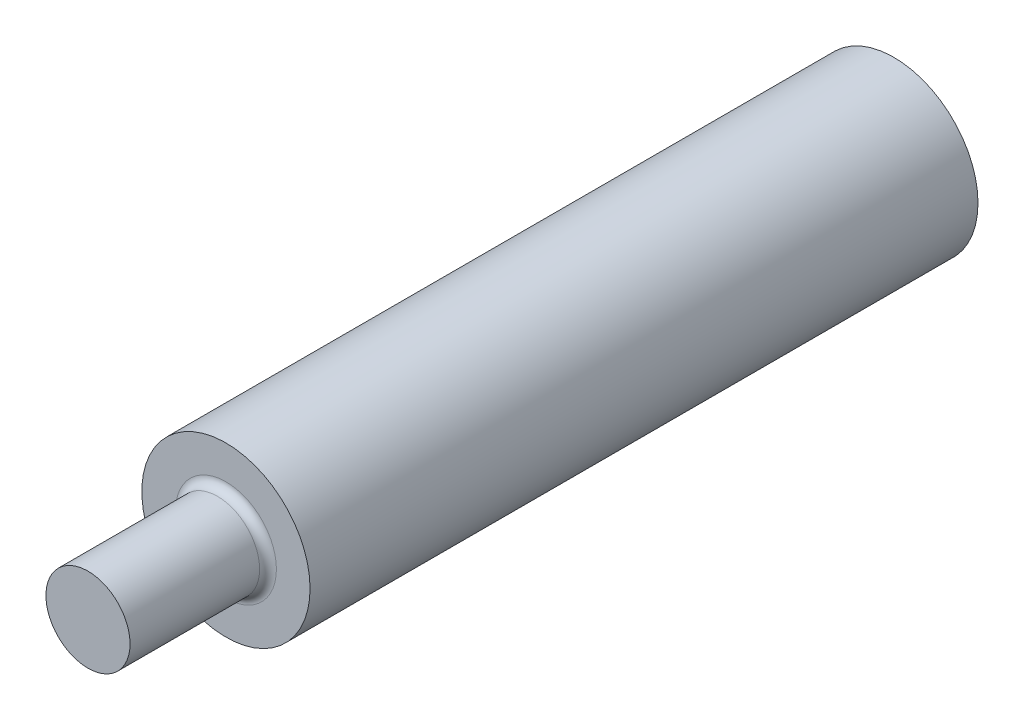
ISO-10303-21;
HEADER;
FILE_DESCRIPTION(('STEP AP214'),'2;1');
FILE_NAME('part.step','',(''),(''),'','','');
FILE_SCHEMA(('AUTOMOTIVE_DESIGN { 1 0 10303 214 1 1 1 1 }'));
ENDSEC;
DATA;
#1=APPLICATION_CONTEXT('core data for automotive mechanical design processes');
#2=APPLICATION_PROTOCOL_DEFINITION('international standard','automotive_design',2000,#1);
#3=PRODUCT_CONTEXT('',#1,'mechanical');
#4=PRODUCT('Part','Part','',(#3));
#5=PRODUCT_RELATED_PRODUCT_CATEGORY('part','',(#4));
#6=PRODUCT_DEFINITION_FORMATION('','',#4);
#7=PRODUCT_DEFINITION_CONTEXT('part definition',#1,'design');
#8=PRODUCT_DEFINITION('design','',#6,#7);
#9=PRODUCT_DEFINITION_SHAPE('','',#8);
#10=(LENGTH_UNIT() NAMED_UNIT(*) SI_UNIT(.MILLI.,.METRE.));
#11=(NAMED_UNIT(*) PLANE_ANGLE_UNIT() SI_UNIT($,.RADIAN.));
#12=(NAMED_UNIT(*) SI_UNIT($,.STERADIAN.) SOLID_ANGLE_UNIT());
#13=UNCERTAINTY_MEASURE_WITH_UNIT(LENGTH_MEASURE(1.E-05),#10,'distance_accuracy_value','');
#14=(GEOMETRIC_REPRESENTATION_CONTEXT(3) GLOBAL_UNCERTAINTY_ASSIGNED_CONTEXT((#13)) GLOBAL_UNIT_ASSIGNED_CONTEXT((#10,
#11,#12)) REPRESENTATION_CONTEXT('',''));
#15=CARTESIAN_POINT('',(0.,0.,0.));
#16=DIRECTION('',(0.,0.,1.));
#17=DIRECTION('',(1.,0.,0.));
#18=AXIS2_PLACEMENT_3D('',#15,#16,#17);
#19=CARTESIAN_POINT('',(0.,0.,15.));
#20=DIRECTION('',(0.,0.,-1.));
#21=DIRECTION('',(-1.,0.,0.));
#22=AXIS2_PLACEMENT_3D('',#19,#20,#21);
#23=CYLINDRICAL_SURFACE('',#22,25.);
#24=CARTESIAN_POINT('',(0.,0.,10.));
#25=DIRECTION('',(0.,0.,1.));
#26=DIRECTION('',(1.,0.,0.));
#27=AXIS2_PLACEMENT_3D('',#24,#25,#26);
#28=CIRCLE('',#27,25.);
#29=CARTESIAN_POINT('',(25.,0.,10.));
#30=VERTEX_POINT('',#29);
#31=EDGE_CURVE('E10',#30,#30,#28,.F.);
#32=ORIENTED_EDGE('',*,*,#31,.T.);
#33=EDGE_LOOP('',(#32));
#34=FACE_BOUND('',#33,.T.);
#35=CARTESIAN_POINT('',(0.,0.,0.));
#36=DIRECTION('',(0.,0.,1.));
#37=DIRECTION('',(1.,0.,0.));
#38=AXIS2_PLACEMENT_3D('',#35,#36,#37);
#39=CIRCLE('',#38,25.);
#40=CARTESIAN_POINT('',(25.,0.,0.));
#41=VERTEX_POINT('',#40);
#42=EDGE_CURVE('E51',#41,#41,#39,.T.);
#43=ORIENTED_EDGE('',*,*,#42,.T.);
#44=EDGE_LOOP('',(#43));
#45=FACE_BOUND('',#44,.T.);
#46=ADVANCED_FACE('F31',(#34,#45),#23,.T.);
#47=CARTESIAN_POINT('',(0.,0.,0.));
#48=DIRECTION('',(0.,0.,1.));
#49=DIRECTION('',(1.,0.,0.));
#50=AXIS2_PLACEMENT_3D('',#47,#48,#49);
#51=PLANE('',#50);
#52=ORIENTED_EDGE('',*,*,#42,.F.);
#53=EDGE_LOOP('',(#52));
#54=FACE_BOUND('',#53,.T.);
#55=ADVANCED_FACE('F81',(#54),#51,.F.);
#56=CARTESIAN_POINT('',(0.,0.,412.));
#57=DIRECTION('',(0.,0.,-1.));
#58=DIRECTION('',(-1.,0.,0.));
#59=AXIS2_PLACEMENT_3D('',#56,#57,#58);
#60=CYLINDRICAL_SURFACE('',#59,50.);
#61=CARTESIAN_POINT('',(0.,0.,412.));
#62=DIRECTION('',(0.,0.,1.));
#63=DIRECTION('',(1.,0.,0.));
#64=AXIS2_PLACEMENT_3D('',#61,#62,#63);
#65=CIRCLE('',#64,50.);
#66=CARTESIAN_POINT('',(50.,0.,412.));
#67=VERTEX_POINT('',#66);
#68=EDGE_CURVE('E54',#67,#67,#65,.T.);
#69=ORIENTED_EDGE('',*,*,#68,.F.);
#70=EDGE_LOOP('',(#69));
#71=FACE_BOUND('',#70,.T.);
#72=CARTESIAN_POINT('',(0.,0.,15.));
#73=DIRECTION('',(0.,0.,1.));
#74=DIRECTION('',(1.,0.,0.));
#75=AXIS2_PLACEMENT_3D('',#72,#73,#74);
#76=CIRCLE('',#75,50.);
#77=CARTESIAN_POINT('',(50.,0.,15.));
#78=VERTEX_POINT('',#77);
#79=EDGE_CURVE('E55',#78,#78,#76,.T.);
#80=ORIENTED_EDGE('',*,*,#79,.T.);
#81=EDGE_LOOP('',(#80));
#82=FACE_BOUND('',#81,.T.);
#83=ADVANCED_FACE('F86',(#71,#82),#60,.T.);
#84=CARTESIAN_POINT('',(0.,0.,412.));
#85=DIRECTION('',(0.,0.,1.));
#86=DIRECTION('',(1.,0.,0.));
#87=AXIS2_PLACEMENT_3D('',#84,#85,#86);
#88=PLANE('',#87);
#89=CARTESIAN_POINT('',(0.,0.,412.));
#90=DIRECTION('',(0.,0.,1.));
#91=DIRECTION('',(1.,0.,0.));
#92=AXIS2_PLACEMENT_3D('',#89,#90,#91);
#93=CIRCLE('',#92,30.);
#94=CARTESIAN_POINT('',(30.,0.,412.));
#95=VERTEX_POINT('',#94);
#96=EDGE_CURVE('E42',#95,#95,#93,.F.);
#97=ORIENTED_EDGE('',*,*,#96,.T.);
#98=EDGE_LOOP('',(#97));
#99=FACE_BOUND('',#98,.T.);
#100=ORIENTED_EDGE('',*,*,#68,.T.);
#101=EDGE_LOOP('',(#100));
#102=FACE_BOUND('',#101,.T.);
#103=ADVANCED_FACE('F77',(#99,#102),#88,.T.);
#104=CARTESIAN_POINT('',(0.,0.,15.));
#105=DIRECTION('',(0.,0.,1.));
#106=DIRECTION('',(1.,0.,0.));
#107=AXIS2_PLACEMENT_3D('',#104,#105,#106);
#108=PLANE('',#107);
#109=CARTESIAN_POINT('',(0.,0.,15.));
#110=DIRECTION('',(0.,0.,1.));
#111=DIRECTION('',(1.,0.,0.));
#112=AXIS2_PLACEMENT_3D('',#109,#110,#111);
#113=CIRCLE('',#112,30.);
#114=CARTESIAN_POINT('',(30.,0.,15.));
#115=VERTEX_POINT('',#114);
#116=EDGE_CURVE('E38',#115,#115,#113,.T.);
#117=ORIENTED_EDGE('',*,*,#116,.T.);
#118=EDGE_LOOP('',(#117));
#119=FACE_BOUND('',#118,.T.);
#120=ORIENTED_EDGE('',*,*,#79,.F.);
#121=EDGE_LOOP('',(#120));
#122=FACE_BOUND('',#121,.T.);
#123=ADVANCED_FACE('F68',(#119,#122),#108,.F.);
#124=CARTESIAN_POINT('',(0.,0.,494.));
#125=DIRECTION('',(0.,0.,-1.));
#126=DIRECTION('',(-1.,0.,0.));
#127=AXIS2_PLACEMENT_3D('',#124,#125,#126);
#128=CYLINDRICAL_SURFACE('',#127,25.);
#129=CARTESIAN_POINT('',(0.,0.,417.));
#130=DIRECTION('',(0.,0.,1.));
#131=DIRECTION('',(1.,0.,0.));
#132=AXIS2_PLACEMENT_3D('',#129,#130,#131);
#133=CIRCLE('',#132,25.);
#134=CARTESIAN_POINT('',(25.,0.,417.));
#135=VERTEX_POINT('',#134);
#136=EDGE_CURVE('E46',#135,#135,#133,.T.);
#137=ORIENTED_EDGE('',*,*,#136,.T.);
#138=EDGE_LOOP('',(#137));
#139=FACE_BOUND('',#138,.T.);
#140=CARTESIAN_POINT('',(0.,0.,494.));
#141=DIRECTION('',(0.,0.,1.));
#142=DIRECTION('',(1.,0.,0.));
#143=AXIS2_PLACEMENT_3D('',#140,#141,#142);
#144=CIRCLE('',#143,25.);
#145=CARTESIAN_POINT('',(25.,0.,494.));
#146=VERTEX_POINT('',#145);
#147=EDGE_CURVE('E58',#146,#146,#144,.T.);
#148=ORIENTED_EDGE('',*,*,#147,.F.);
#149=EDGE_LOOP('',(#148));
#150=FACE_BOUND('',#149,.T.);
#151=ADVANCED_FACE('F66',(#139,#150),#128,.T.);
#152=CARTESIAN_POINT('',(0.,0.,494.));
#153=DIRECTION('',(0.,0.,1.));
#154=DIRECTION('',(1.,0.,0.));
#155=AXIS2_PLACEMENT_3D('',#152,#153,#154);
#156=PLANE('',#155);
#157=ORIENTED_EDGE('',*,*,#147,.T.);
#158=EDGE_LOOP('',(#157));
#159=FACE_BOUND('',#158,.T.);
#160=ADVANCED_FACE('F64',(#159),#156,.T.);
#161=CARTESIAN_POINT('',(0.,0.,417.));
#162=DIRECTION('',(0.,0.,1.));
#163=DIRECTION('',(1.,0.,0.));
#164=AXIS2_PLACEMENT_3D('',#161,#162,#163);
#165=TOROIDAL_SURFACE('',#164,30.,5.);
#166=ORIENTED_EDGE('',*,*,#96,.F.);
#167=EDGE_LOOP('',(#166));
#168=FACE_BOUND('',#167,.T.);
#169=ORIENTED_EDGE('',*,*,#136,.F.);
#170=EDGE_LOOP('',(#169));
#171=FACE_BOUND('',#170,.T.);
#172=ADVANCED_FACE('F75',(#168,#171),#165,.F.);
#173=CARTESIAN_POINT('',(0.,0.,10.));
#174=DIRECTION('',(0.,0.,1.));
#175=DIRECTION('',(1.,0.,0.));
#176=AXIS2_PLACEMENT_3D('',#173,#174,#175);
#177=TOROIDAL_SURFACE('',#176,30.,5.);
#178=ORIENTED_EDGE('',*,*,#31,.F.);
#179=EDGE_LOOP('',(#178));
#180=FACE_BOUND('',#179,.T.);
#181=ORIENTED_EDGE('',*,*,#116,.F.);
#182=EDGE_LOOP('',(#181));
#183=FACE_BOUND('',#182,.T.);
#184=ADVANCED_FACE('F33',(#180,#183),#177,.F.);
#185=CLOSED_SHELL('',(#46,#55,#83,#103,#123,#151,#160,#172,#184));
#186=MANIFOLD_SOLID_BREP('B2',#185);
#187=ADVANCED_BREP_SHAPE_REPRESENTATION('',(#18,#186),#14);
#188=SHAPE_DEFINITION_REPRESENTATION(#9,#187);
ENDSEC;
END-ISO-10303-21;
